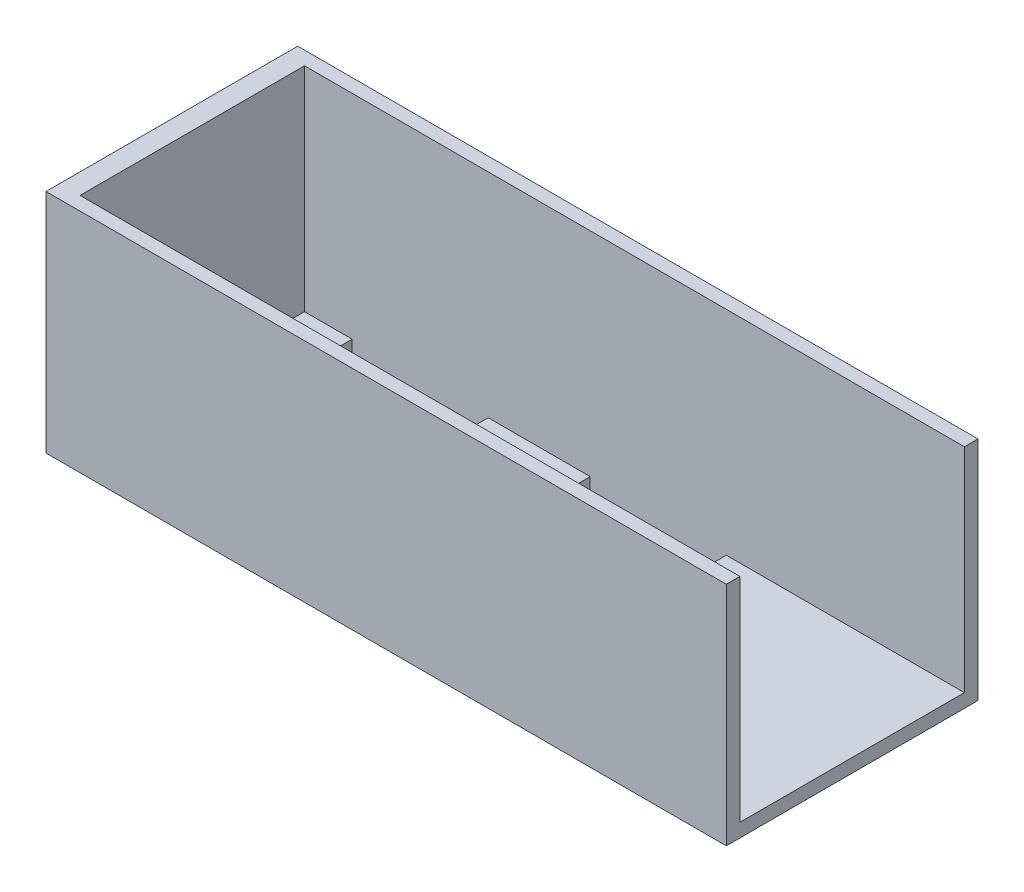
ISO-10303-21;
HEADER;
FILE_DESCRIPTION(('STEP AP214'),'2;1');
FILE_NAME('part.step','',(''),(''),'','','');
FILE_SCHEMA(('AUTOMOTIVE_DESIGN { 1 0 10303 214 1 1 1 1 }'));
ENDSEC;
DATA;
#1=APPLICATION_CONTEXT('core data for automotive mechanical design processes');
#2=APPLICATION_PROTOCOL_DEFINITION('international standard','automotive_design',2000,#1);
#3=PRODUCT_CONTEXT('',#1,'mechanical');
#4=PRODUCT('Part','Part','',(#3));
#5=PRODUCT_RELATED_PRODUCT_CATEGORY('part','',(#4));
#6=PRODUCT_DEFINITION_FORMATION('','',#4);
#7=PRODUCT_DEFINITION_CONTEXT('part definition',#1,'design');
#8=PRODUCT_DEFINITION('design','',#6,#7);
#9=PRODUCT_DEFINITION_SHAPE('','',#8);
#10=(LENGTH_UNIT() NAMED_UNIT(*) SI_UNIT(.MILLI.,.METRE.));
#11=(NAMED_UNIT(*) PLANE_ANGLE_UNIT() SI_UNIT($,.RADIAN.));
#12=(NAMED_UNIT(*) SI_UNIT($,.STERADIAN.) SOLID_ANGLE_UNIT());
#13=UNCERTAINTY_MEASURE_WITH_UNIT(LENGTH_MEASURE(1.E-05),#10,'distance_accuracy_value','');
#14=(GEOMETRIC_REPRESENTATION_CONTEXT(3) GLOBAL_UNCERTAINTY_ASSIGNED_CONTEXT((#13)) GLOBAL_UNIT_ASSIGNED_CONTEXT((#10,
#11,#12)) REPRESENTATION_CONTEXT('',''));
#15=CARTESIAN_POINT('',(0.,0.,0.));
#16=DIRECTION('',(0.,0.,1.));
#17=DIRECTION('',(1.,0.,0.));
#18=AXIS2_PLACEMENT_3D('',#15,#16,#17);
#19=CARTESIAN_POINT('',(50.,0.,-16.));
#20=DIRECTION('',(0.,0.,-1.));
#21=DIRECTION('',(0.,1.,0.));
#22=AXIS2_PLACEMENT_3D('',#19,#20,#21);
#23=PLANE('',#22);
#24=DIRECTION('',(-1.,0.,0.));
#25=VECTOR('',#24,1.);
#26=CARTESIAN_POINT('',(50.,0.,-16.));
#27=LINE('',#26,#25);
#28=CARTESIAN_POINT('',(50.,0.,-16.));
#29=VERTEX_POINT('',#28);
#30=CARTESIAN_POINT('',(-47.,0.,-16.));
#31=VERTEX_POINT('',#30);
#32=EDGE_CURVE('E384',#29,#31,#27,.T.);
#33=ORIENTED_EDGE('',*,*,#32,.T.);
#34=DIRECTION('',(0.,1.,0.));
#35=VECTOR('',#34,1.);
#36=CARTESIAN_POINT('',(-47.,0.,-16.));
#37=LINE('',#36,#35);
#38=CARTESIAN_POINT('',(-47.,-31.3,-16.));
#39=VERTEX_POINT('',#38);
#40=EDGE_CURVE('E325',#39,#31,#37,.T.);
#41=ORIENTED_EDGE('',*,*,#40,.F.);
#42=DIRECTION('',(-1.,0.,0.));
#43=VECTOR('',#42,1.);
#44=CARTESIAN_POINT('',(50.,-31.3,-16.));
#45=LINE('',#44,#43);
#46=CARTESIAN_POINT('',(-40.,-31.3,-16.));
#47=VERTEX_POINT('',#46);
#48=EDGE_CURVE('E378',#47,#39,#45,.T.);
#49=ORIENTED_EDGE('',*,*,#48,.F.);
#50=DIRECTION('',(0.,1.,0.));
#51=VECTOR('',#50,1.);
#52=CARTESIAN_POINT('',(-40.,-50.,-16.));
#53=LINE('',#52,#51);
#54=CARTESIAN_POINT('',(-40.,-33.3,-16.));
#55=VERTEX_POINT('',#54);
#56=EDGE_CURVE('E463',#55,#47,#53,.T.);
#57=ORIENTED_EDGE('',*,*,#56,.F.);
#58=DIRECTION('',(-1.,0.,0.));
#59=VECTOR('',#58,1.);
#60=CARTESIAN_POINT('',(50.,-33.3,-16.));
#61=LINE('',#60,#59);
#62=CARTESIAN_POINT('',(-20.,-33.3,-16.));
#63=VERTEX_POINT('',#62);
#64=EDGE_CURVE('E269',#63,#55,#61,.T.);
#65=ORIENTED_EDGE('',*,*,#64,.F.);
#66=DIRECTION('',(0.,1.,0.));
#67=VECTOR('',#66,1.);
#68=CARTESIAN_POINT('',(-20.,-50.,-16.));
#69=LINE('',#68,#67);
#70=CARTESIAN_POINT('',(-20.,-31.3,-16.));
#71=VERTEX_POINT('',#70);
#72=EDGE_CURVE('E425',#63,#71,#69,.T.);
#73=ORIENTED_EDGE('',*,*,#72,.T.);
#74=CARTESIAN_POINT('',(-4.99999999999999,-31.3,-16.));
#75=VERTEX_POINT('',#74);
#76=EDGE_CURVE('E385',#75,#71,#45,.T.);
#77=ORIENTED_EDGE('',*,*,#76,.F.);
#78=DIRECTION('',(0.,1.,0.));
#79=VECTOR('',#78,1.);
#80=CARTESIAN_POINT('',(-4.99999999999999,-50.,-16.));
#81=LINE('',#80,#79);
#82=CARTESIAN_POINT('',(-4.99999999999999,-33.3,-16.));
#83=VERTEX_POINT('',#82);
#84=EDGE_CURVE('E421',#83,#75,#81,.T.);
#85=ORIENTED_EDGE('',*,*,#84,.F.);
#86=DIRECTION('',(-1.,0.,0.));
#87=VECTOR('',#86,1.);
#88=CARTESIAN_POINT('',(50.,-33.3,-16.));
#89=LINE('',#88,#87);
#90=CARTESIAN_POINT('',(15.,-33.3,-16.));
#91=VERTEX_POINT('',#90);
#92=EDGE_CURVE('E249',#91,#83,#89,.T.);
#93=ORIENTED_EDGE('',*,*,#92,.F.);
#94=DIRECTION('',(0.,1.,0.));
#95=VECTOR('',#94,1.);
#96=CARTESIAN_POINT('',(15.,-50.,-16.));
#97=LINE('',#96,#95);
#98=CARTESIAN_POINT('',(15.,-31.3,-16.));
#99=VERTEX_POINT('',#98);
#100=EDGE_CURVE('E427',#91,#99,#97,.T.);
#101=ORIENTED_EDGE('',*,*,#100,.T.);
#102=CARTESIAN_POINT('',(50.,-31.3,-16.));
#103=VERTEX_POINT('',#102);
#104=EDGE_CURVE('E380',#103,#99,#45,.T.);
#105=ORIENTED_EDGE('',*,*,#104,.F.);
#106=DIRECTION('',(0.,-1.,0.));
#107=VECTOR('',#106,1.);
#108=CARTESIAN_POINT('',(50.,0.,-16.));
#109=LINE('',#108,#107);
#110=EDGE_CURVE('E347',#29,#103,#109,.T.);
#111=ORIENTED_EDGE('',*,*,#110,.F.);
#112=EDGE_LOOP('',(#33,#41,#49,#57,#65,#73,#77,#85,#93,#101,#105,#111));
#113=FACE_BOUND('',#112,.T.);
#114=ADVANCED_FACE('F39',(#113),#23,.F.);
#115=CARTESIAN_POINT('',(50.,-31.3,17.));
#116=DIRECTION('',(0.,-1.,0.));
#117=DIRECTION('',(0.,0.,-1.));
#118=AXIS2_PLACEMENT_3D('',#115,#116,#117);
#119=PLANE('',#118);
#120=DIRECTION('',(1.,0.,0.));
#121=VECTOR('',#120,1.);
#122=CARTESIAN_POINT('',(50.,-31.3,9.99999999999999));
#123=LINE('',#122,#121);
#124=CARTESIAN_POINT('',(-4.99999999999999,-31.3,10.));
#125=VERTEX_POINT('',#124);
#126=CARTESIAN_POINT('',(15.,-31.3,10.));
#127=VERTEX_POINT('',#126);
#128=EDGE_CURVE('E313',#125,#127,#123,.T.);
#129=ORIENTED_EDGE('',*,*,#128,.T.);
#130=DIRECTION('',(0.,0.,1.));
#131=VECTOR('',#130,1.);
#132=CARTESIAN_POINT('',(15.,-31.3,17.));
#133=LINE('',#132,#131);
#134=CARTESIAN_POINT('',(15.,-31.3,17.));
#135=VERTEX_POINT('',#134);
#136=EDGE_CURVE('E297',#127,#135,#133,.T.);
#137=ORIENTED_EDGE('',*,*,#136,.T.);
#138=DIRECTION('',(-1.,0.,0.));
#139=VECTOR('',#138,1.);
#140=CARTESIAN_POINT('',(50.,-31.3,17.));
#141=LINE('',#140,#139);
#142=CARTESIAN_POINT('',(50.,-31.3,17.));
#143=VERTEX_POINT('',#142);
#144=EDGE_CURVE('E374',#143,#135,#141,.T.);
#145=ORIENTED_EDGE('',*,*,#144,.F.);
#146=DIRECTION('',(0.,0.,1.));
#147=VECTOR('',#146,1.);
#148=CARTESIAN_POINT('',(50.,-31.3,17.));
#149=LINE('',#148,#147);
#150=EDGE_CURVE('E350',#103,#143,#149,.T.);
#151=ORIENTED_EDGE('',*,*,#150,.F.);
#152=ORIENTED_EDGE('',*,*,#104,.T.);
#153=DIRECTION('',(0.,0.,1.));
#154=VECTOR('',#153,1.);
#155=CARTESIAN_POINT('',(15.,-31.3,17.));
#156=LINE('',#155,#154);
#157=CARTESIAN_POINT('',(15.,-31.3,-9.));
#158=VERTEX_POINT('',#157);
#159=EDGE_CURVE('E245',#99,#158,#156,.T.);
#160=ORIENTED_EDGE('',*,*,#159,.T.);
#161=DIRECTION('',(-1.,0.,0.));
#162=VECTOR('',#161,1.);
#163=CARTESIAN_POINT('',(50.,-31.3,-9.));
#164=LINE('',#163,#162);
#165=CARTESIAN_POINT('',(-4.99999999999999,-31.3,-9.));
#166=VERTEX_POINT('',#165);
#167=EDGE_CURVE('E305',#158,#166,#164,.T.);
#168=ORIENTED_EDGE('',*,*,#167,.T.);
#169=DIRECTION('',(0.,0.,-1.));
#170=VECTOR('',#169,1.);
#171=CARTESIAN_POINT('',(-4.99999999999999,-31.3,17.));
#172=LINE('',#171,#170);
#173=EDGE_CURVE('E257',#166,#75,#172,.T.);
#174=ORIENTED_EDGE('',*,*,#173,.T.);
#175=ORIENTED_EDGE('',*,*,#76,.T.);
#176=DIRECTION('',(0.,0.,1.));
#177=VECTOR('',#176,1.);
#178=CARTESIAN_POINT('',(-20.,-31.3,17.));
#179=LINE('',#178,#177);
#180=CARTESIAN_POINT('',(-20.,-31.3,-9.));
#181=VERTEX_POINT('',#180);
#182=EDGE_CURVE('E265',#71,#181,#179,.T.);
#183=ORIENTED_EDGE('',*,*,#182,.T.);
#184=DIRECTION('',(-1.,0.,0.));
#185=VECTOR('',#184,1.);
#186=CARTESIAN_POINT('',(50.,-31.3,-9.));
#187=LINE('',#186,#185);
#188=CARTESIAN_POINT('',(-40.,-31.3,-9.));
#189=VERTEX_POINT('',#188);
#190=EDGE_CURVE('E309',#181,#189,#187,.T.);
#191=ORIENTED_EDGE('',*,*,#190,.T.);
#192=DIRECTION('',(0.,0.,-1.));
#193=VECTOR('',#192,1.);
#194=CARTESIAN_POINT('',(-40.,-31.3,17.));
#195=LINE('',#194,#193);
#196=EDGE_CURVE('E277',#189,#47,#195,.T.);
#197=ORIENTED_EDGE('',*,*,#196,.T.);
#198=ORIENTED_EDGE('',*,*,#48,.T.);
#199=DIRECTION('',(0.,0.,-1.));
#200=VECTOR('',#199,1.);
#201=CARTESIAN_POINT('',(-47.,-31.3,17.));
#202=LINE('',#201,#200);
#203=CARTESIAN_POINT('',(-47.,-31.3,17.));
#204=VERTEX_POINT('',#203);
#205=EDGE_CURVE('E321',#204,#39,#202,.T.);
#206=ORIENTED_EDGE('',*,*,#205,.F.);
#207=CARTESIAN_POINT('',(-40.,-31.3,17.));
#208=VERTEX_POINT('',#207);
#209=EDGE_CURVE('E373',#208,#204,#141,.T.);
#210=ORIENTED_EDGE('',*,*,#209,.F.);
#211=DIRECTION('',(0.,0.,-1.));
#212=VECTOR('',#211,1.);
#213=CARTESIAN_POINT('',(-40.,-31.3,17.));
#214=LINE('',#213,#212);
#215=CARTESIAN_POINT('',(-40.,-31.3,9.99999999999998));
#216=VERTEX_POINT('',#215);
#217=EDGE_CURVE('E222',#208,#216,#214,.T.);
#218=ORIENTED_EDGE('',*,*,#217,.T.);
#219=DIRECTION('',(1.,0.,0.));
#220=VECTOR('',#219,1.);
#221=CARTESIAN_POINT('',(50.,-31.3,9.99999999999998));
#222=LINE('',#221,#220);
#223=CARTESIAN_POINT('',(-20.,-31.3,9.99999999999998));
#224=VERTEX_POINT('',#223);
#225=EDGE_CURVE('E301',#216,#224,#222,.T.);
#226=ORIENTED_EDGE('',*,*,#225,.T.);
#227=DIRECTION('',(0.,0.,1.));
#228=VECTOR('',#227,1.);
#229=CARTESIAN_POINT('',(-20.,-31.3,17.));
#230=LINE('',#229,#228);
#231=CARTESIAN_POINT('',(-20.,-31.3,17.));
#232=VERTEX_POINT('',#231);
#233=EDGE_CURVE('E232',#224,#232,#230,.T.);
#234=ORIENTED_EDGE('',*,*,#233,.T.);
#235=CARTESIAN_POINT('',(-4.99999999999999,-31.3,17.));
#236=VERTEX_POINT('',#235);
#237=EDGE_CURVE('E379',#236,#232,#141,.T.);
#238=ORIENTED_EDGE('',*,*,#237,.F.);
#239=DIRECTION('',(0.,0.,-1.));
#240=VECTOR('',#239,1.);
#241=CARTESIAN_POINT('',(-4.99999999999999,-31.3,17.));
#242=LINE('',#241,#240);
#243=EDGE_CURVE('E285',#236,#125,#242,.T.);
#244=ORIENTED_EDGE('',*,*,#243,.T.);
#245=EDGE_LOOP('',(#129,#137,#145,#151,#152,#160,#168,#174,#175,#183,#191,#197,#198,#206,#210,
#218,#226,#234,#238,#244));
#246=FACE_BOUND('',#245,.T.);
#247=ADVANCED_FACE('F445',(#246),#119,.F.);
#248=CARTESIAN_POINT('',(50.,0.,17.));
#249=DIRECTION('',(0.,0.,1.));
#250=DIRECTION('',(0.,-1.,0.));
#251=AXIS2_PLACEMENT_3D('',#248,#249,#250);
#252=PLANE('',#251);
#253=DIRECTION('',(0.,-1.,0.));
#254=VECTOR('',#253,1.);
#255=CARTESIAN_POINT('',(-47.,0.,17.));
#256=LINE('',#255,#254);
#257=CARTESIAN_POINT('',(-47.,0.,17.));
#258=VERTEX_POINT('',#257);
#259=EDGE_CURVE('E400',#258,#204,#256,.T.);
#260=ORIENTED_EDGE('',*,*,#259,.F.);
#261=DIRECTION('',(-1.,0.,0.));
#262=VECTOR('',#261,1.);
#263=CARTESIAN_POINT('',(50.,0.,17.));
#264=LINE('',#263,#262);
#265=CARTESIAN_POINT('',(50.,0.,17.));
#266=VERTEX_POINT('',#265);
#267=EDGE_CURVE('E356',#266,#258,#264,.T.);
#268=ORIENTED_EDGE('',*,*,#267,.F.);
#269=DIRECTION('',(0.,1.,0.));
#270=VECTOR('',#269,1.);
#271=CARTESIAN_POINT('',(50.,0.,17.));
#272=LINE('',#271,#270);
#273=EDGE_CURVE('E353',#143,#266,#272,.T.);
#274=ORIENTED_EDGE('',*,*,#273,.F.);
#275=ORIENTED_EDGE('',*,*,#144,.T.);
#276=DIRECTION('',(0.,1.,0.));
#277=VECTOR('',#276,1.);
#278=CARTESIAN_POINT('',(15.,-50.,17.));
#279=LINE('',#278,#277);
#280=CARTESIAN_POINT('',(15.,-33.3,17.));
#281=VERTEX_POINT('',#280);
#282=EDGE_CURVE('E225',#281,#135,#279,.T.);
#283=ORIENTED_EDGE('',*,*,#282,.F.);
#284=DIRECTION('',(1.,0.,0.));
#285=VECTOR('',#284,1.);
#286=CARTESIAN_POINT('',(50.,-33.3,17.));
#287=LINE('',#286,#285);
#288=CARTESIAN_POINT('',(-4.99999999999999,-33.3,17.));
#289=VERTEX_POINT('',#288);
#290=EDGE_CURVE('E289',#289,#281,#287,.T.);
#291=ORIENTED_EDGE('',*,*,#290,.F.);
#292=DIRECTION('',(0.,1.,0.));
#293=VECTOR('',#292,1.);
#294=CARTESIAN_POINT('',(-4.99999999999999,-50.,17.));
#295=LINE('',#294,#293);
#296=EDGE_CURVE('E452',#289,#236,#295,.T.);
#297=ORIENTED_EDGE('',*,*,#296,.T.);
#298=ORIENTED_EDGE('',*,*,#237,.T.);
#299=DIRECTION('',(0.,1.,0.));
#300=VECTOR('',#299,1.);
#301=CARTESIAN_POINT('',(-20.,-50.,17.));
#302=LINE('',#301,#300);
#303=CARTESIAN_POINT('',(-20.,-33.3,17.));
#304=VERTEX_POINT('',#303);
#305=EDGE_CURVE('E207',#304,#232,#302,.T.);
#306=ORIENTED_EDGE('',*,*,#305,.F.);
#307=DIRECTION('',(1.,0.,0.));
#308=VECTOR('',#307,1.);
#309=CARTESIAN_POINT('',(50.,-33.3,17.));
#310=LINE('',#309,#308);
#311=CARTESIAN_POINT('',(-40.,-33.3,17.));
#312=VERTEX_POINT('',#311);
#313=EDGE_CURVE('E200',#312,#304,#310,.T.);
#314=ORIENTED_EDGE('',*,*,#313,.F.);
#315=DIRECTION('',(0.,1.,0.));
#316=VECTOR('',#315,1.);
#317=CARTESIAN_POINT('',(-40.,-50.,17.));
#318=LINE('',#317,#316);
#319=EDGE_CURVE('E204',#312,#208,#318,.T.);
#320=ORIENTED_EDGE('',*,*,#319,.T.);
#321=ORIENTED_EDGE('',*,*,#209,.T.);
#322=EDGE_LOOP('',(#260,#268,#274,#275,#283,#291,#297,#298,#306,#314,#320,#321));
#323=FACE_BOUND('',#322,.T.);
#324=ADVANCED_FACE('F203',(#323),#252,.F.);
#325=CARTESIAN_POINT('',(50.,0.,19.));
#326=DIRECTION('',(0.,0.,-1.));
#327=DIRECTION('',(0.,1.,0.));
#328=AXIS2_PLACEMENT_3D('',#325,#326,#327);
#329=PLANE('',#328);
#330=DIRECTION('',(0.,-1.,0.));
#331=VECTOR('',#330,1.);
#332=CARTESIAN_POINT('',(-50.,0.,19.));
#333=LINE('',#332,#331);
#334=CARTESIAN_POINT('',(-50.,0.,19.));
#335=VERTEX_POINT('',#334);
#336=CARTESIAN_POINT('',(-50.,-33.3,19.));
#337=VERTEX_POINT('',#336);
#338=EDGE_CURVE('E329',#335,#337,#333,.T.);
#339=ORIENTED_EDGE('',*,*,#338,.T.);
#340=DIRECTION('',(-1.,0.,0.));
#341=VECTOR('',#340,1.);
#342=CARTESIAN_POINT('',(50.,-33.3,19.));
#343=LINE('',#342,#341);
#344=CARTESIAN_POINT('',(50.,-33.3,19.));
#345=VERTEX_POINT('',#344);
#346=EDGE_CURVE('E394',#345,#337,#343,.T.);
#347=ORIENTED_EDGE('',*,*,#346,.F.);
#348=DIRECTION('',(0.,-1.,0.));
#349=VECTOR('',#348,1.);
#350=CARTESIAN_POINT('',(50.,0.,19.));
#351=LINE('',#350,#349);
#352=CARTESIAN_POINT('',(50.,0.,19.));
#353=VERTEX_POINT('',#352);
#354=EDGE_CURVE('E334',#353,#345,#351,.T.);
#355=ORIENTED_EDGE('',*,*,#354,.F.);
#356=DIRECTION('',(-1.,0.,0.));
#357=VECTOR('',#356,1.);
#358=CARTESIAN_POINT('',(50.,0.,19.));
#359=LINE('',#358,#357);
#360=EDGE_CURVE('E397',#353,#335,#359,.T.);
#361=ORIENTED_EDGE('',*,*,#360,.T.);
#362=EDGE_LOOP('',(#339,#347,#355,#361));
#363=FACE_BOUND('',#362,.T.);
#364=ADVANCED_FACE('F41',(#363),#329,.F.);
#365=CARTESIAN_POINT('',(50.,-33.3,19.));
#366=DIRECTION('',(0.,1.,0.));
#367=DIRECTION('',(0.,0.,1.));
#368=AXIS2_PLACEMENT_3D('',#365,#366,#367);
#369=PLANE('',#368);
#370=ORIENTED_EDGE('',*,*,#290,.T.);
#371=DIRECTION('',(0.,0.,-1.));
#372=VECTOR('',#371,1.);
#373=CARTESIAN_POINT('',(15.,-33.3,19.));
#374=LINE('',#373,#372);
#375=CARTESIAN_POINT('',(15.,-33.3,10.));
#376=VERTEX_POINT('',#375);
#377=EDGE_CURVE('E293',#281,#376,#374,.T.);
#378=ORIENTED_EDGE('',*,*,#377,.T.);
#379=DIRECTION('',(-1.,0.,0.));
#380=VECTOR('',#379,1.);
#381=CARTESIAN_POINT('',(50.,-33.3,10.));
#382=LINE('',#381,#380);
#383=CARTESIAN_POINT('',(-4.99999999999999,-33.3,10.));
#384=VERTEX_POINT('',#383);
#385=EDGE_CURVE('E11',#376,#384,#382,.T.);
#386=ORIENTED_EDGE('',*,*,#385,.T.);
#387=DIRECTION('',(0.,0.,1.));
#388=VECTOR('',#387,1.);
#389=CARTESIAN_POINT('',(-4.99999999999999,-33.3,19.));
#390=LINE('',#389,#388);
#391=EDGE_CURVE('E281',#384,#289,#390,.T.);
#392=ORIENTED_EDGE('',*,*,#391,.T.);
#393=EDGE_LOOP('',(#370,#378,#386,#392));
#394=FACE_BOUND('',#393,.T.);
#395=ORIENTED_EDGE('',*,*,#64,.T.);
#396=DIRECTION('',(0.,0.,1.));
#397=VECTOR('',#396,1.);
#398=CARTESIAN_POINT('',(-40.,-33.3,19.));
#399=LINE('',#398,#397);
#400=CARTESIAN_POINT('',(-40.,-33.3,-9.));
#401=VERTEX_POINT('',#400);
#402=EDGE_CURVE('E273',#55,#401,#399,.T.);
#403=ORIENTED_EDGE('',*,*,#402,.T.);
#404=DIRECTION('',(1.,0.,0.));
#405=VECTOR('',#404,1.);
#406=CARTESIAN_POINT('',(50.,-33.3,-9.));
#407=LINE('',#406,#405);
#408=CARTESIAN_POINT('',(-20.,-33.3,-9.));
#409=VERTEX_POINT('',#408);
#410=EDGE_CURVE('E48',#401,#409,#407,.T.);
#411=ORIENTED_EDGE('',*,*,#410,.T.);
#412=DIRECTION('',(0.,0.,-1.));
#413=VECTOR('',#412,1.);
#414=CARTESIAN_POINT('',(-20.,-33.3,19.));
#415=LINE('',#414,#413);
#416=EDGE_CURVE('E261',#409,#63,#415,.T.);
#417=ORIENTED_EDGE('',*,*,#416,.T.);
#418=EDGE_LOOP('',(#395,#403,#411,#417));
#419=FACE_BOUND('',#418,.T.);
#420=ORIENTED_EDGE('',*,*,#92,.T.);
#421=DIRECTION('',(0.,0.,1.));
#422=VECTOR('',#421,1.);
#423=CARTESIAN_POINT('',(-4.99999999999999,-33.3,19.));
#424=LINE('',#423,#422);
#425=CARTESIAN_POINT('',(-4.99999999999999,-33.3,-9.));
#426=VERTEX_POINT('',#425);
#427=EDGE_CURVE('E253',#83,#426,#424,.T.);
#428=ORIENTED_EDGE('',*,*,#427,.T.);
#429=DIRECTION('',(1.,0.,0.));
#430=VECTOR('',#429,1.);
#431=CARTESIAN_POINT('',(50.,-33.3,-9.));
#432=LINE('',#431,#430);
#433=CARTESIAN_POINT('',(15.,-33.3,-9.));
#434=VERTEX_POINT('',#433);
#435=EDGE_CURVE('E406',#426,#434,#432,.T.);
#436=ORIENTED_EDGE('',*,*,#435,.T.);
#437=DIRECTION('',(0.,0.,-1.));
#438=VECTOR('',#437,1.);
#439=CARTESIAN_POINT('',(15.,-33.3,19.));
#440=LINE('',#439,#438);
#441=EDGE_CURVE('E236',#434,#91,#440,.T.);
#442=ORIENTED_EDGE('',*,*,#441,.T.);
#443=EDGE_LOOP('',(#420,#428,#436,#442));
#444=FACE_BOUND('',#443,.T.);
#445=DIRECTION('',(-1.,0.,0.));
#446=VECTOR('',#445,1.);
#447=CARTESIAN_POINT('',(50.,-33.3,9.99999999999998));
#448=LINE('',#447,#446);
#449=CARTESIAN_POINT('',(-20.,-33.3,9.99999999999998));
#450=VERTEX_POINT('',#449);
#451=CARTESIAN_POINT('',(-40.,-33.3,9.99999999999998));
#452=VERTEX_POINT('',#451);
#453=EDGE_CURVE('E230',#450,#452,#448,.T.);
#454=ORIENTED_EDGE('',*,*,#453,.T.);
#455=DIRECTION('',(0.,0.,1.));
#456=VECTOR('',#455,1.);
#457=CARTESIAN_POINT('',(-40.,-33.3,19.));
#458=LINE('',#457,#456);
#459=EDGE_CURVE('E219',#452,#312,#458,.T.);
#460=ORIENTED_EDGE('',*,*,#459,.T.);
#461=ORIENTED_EDGE('',*,*,#313,.T.);
#462=DIRECTION('',(0.,0.,-1.));
#463=VECTOR('',#462,1.);
#464=CARTESIAN_POINT('',(-20.,-33.3,19.));
#465=LINE('',#464,#463);
#466=EDGE_CURVE('E213',#304,#450,#465,.T.);
#467=ORIENTED_EDGE('',*,*,#466,.T.);
#468=EDGE_LOOP('',(#454,#460,#461,#467));
#469=FACE_BOUND('',#468,.T.);
#470=DIRECTION('',(0.,0.,-1.));
#471=VECTOR('',#470,1.);
#472=CARTESIAN_POINT('',(-50.,-33.3,19.));
#473=LINE('',#472,#471);
#474=CARTESIAN_POINT('',(-50.,-33.3,-18.));
#475=VERTEX_POINT('',#474);
#476=EDGE_CURVE('E360',#337,#475,#473,.T.);
#477=ORIENTED_EDGE('',*,*,#476,.T.);
#478=DIRECTION('',(-1.,0.,0.));
#479=VECTOR('',#478,1.);
#480=CARTESIAN_POINT('',(50.,-33.3,-18.));
#481=LINE('',#480,#479);
#482=CARTESIAN_POINT('',(50.,-33.3,-18.));
#483=VERTEX_POINT('',#482);
#484=EDGE_CURVE('E391',#483,#475,#481,.T.);
#485=ORIENTED_EDGE('',*,*,#484,.F.);
#486=DIRECTION('',(0.,0.,-1.));
#487=VECTOR('',#486,1.);
#488=CARTESIAN_POINT('',(50.,-33.3,19.));
#489=LINE('',#488,#487);
#490=EDGE_CURVE('E338',#345,#483,#489,.T.);
#491=ORIENTED_EDGE('',*,*,#490,.F.);
#492=ORIENTED_EDGE('',*,*,#346,.T.);
#493=EDGE_LOOP('',(#477,#485,#491,#492));
#494=FACE_BOUND('',#493,.T.);
#495=ADVANCED_FACE('F228',(#394,#419,#444,#469,#494),#369,.F.);
#496=CARTESIAN_POINT('',(50.,-33.3,-18.));
#497=DIRECTION('',(0.,0.,1.));
#498=DIRECTION('',(1.,0.,0.));
#499=AXIS2_PLACEMENT_3D('',#496,#497,#498);
#500=PLANE('',#499);
#501=DIRECTION('',(0.,1.,0.));
#502=VECTOR('',#501,1.);
#503=CARTESIAN_POINT('',(-50.,-33.3,-18.));
#504=LINE('',#503,#502);
#505=CARTESIAN_POINT('',(-50.,0.,-18.));
#506=VERTEX_POINT('',#505);
#507=EDGE_CURVE('E364',#475,#506,#504,.T.);
#508=ORIENTED_EDGE('',*,*,#507,.T.);
#509=DIRECTION('',(-1.,0.,0.));
#510=VECTOR('',#509,1.);
#511=CARTESIAN_POINT('',(50.,0.,-18.));
#512=LINE('',#511,#510);
#513=CARTESIAN_POINT('',(50.,0.,-18.));
#514=VERTEX_POINT('',#513);
#515=EDGE_CURVE('E388',#514,#506,#512,.T.);
#516=ORIENTED_EDGE('',*,*,#515,.F.);
#517=DIRECTION('',(0.,1.,0.));
#518=VECTOR('',#517,1.);
#519=CARTESIAN_POINT('',(50.,-33.3,-18.));
#520=LINE('',#519,#518);
#521=EDGE_CURVE('E341',#483,#514,#520,.T.);
#522=ORIENTED_EDGE('',*,*,#521,.F.);
#523=ORIENTED_EDGE('',*,*,#484,.T.);
#524=EDGE_LOOP('',(#508,#516,#522,#523));
#525=FACE_BOUND('',#524,.T.);
#526=ADVANCED_FACE('F524',(#525),#500,.F.);
#527=CARTESIAN_POINT('',(50.,0.,-16.));
#528=DIRECTION('',(0.,-1.,0.));
#529=DIRECTION('',(0.,0.,-1.));
#530=AXIS2_PLACEMENT_3D('',#527,#528,#529);
#531=PLANE('',#530);
#532=DIRECTION('',(0.,0.,1.));
#533=VECTOR('',#532,1.);
#534=CARTESIAN_POINT('',(-50.,0.,-16.));
#535=LINE('',#534,#533);
#536=EDGE_CURVE('E335',#506,#335,#535,.T.);
#537=ORIENTED_EDGE('',*,*,#536,.T.);
#538=ORIENTED_EDGE('',*,*,#360,.F.);
#539=DIRECTION('',(0.,0.,1.));
#540=VECTOR('',#539,1.);
#541=CARTESIAN_POINT('',(50.,0.,19.));
#542=LINE('',#541,#540);
#543=EDGE_CURVE('E330',#266,#353,#542,.T.);
#544=ORIENTED_EDGE('',*,*,#543,.F.);
#545=ORIENTED_EDGE('',*,*,#267,.T.);
#546=DIRECTION('',(0.,0.,-1.));
#547=VECTOR('',#546,1.);
#548=CARTESIAN_POINT('',(-47.,0.,-18.));
#549=LINE('',#548,#547);
#550=EDGE_CURVE('E317',#258,#31,#549,.T.);
#551=ORIENTED_EDGE('',*,*,#550,.T.);
#552=ORIENTED_EDGE('',*,*,#32,.F.);
#553=DIRECTION('',(0.,0.,1.));
#554=VECTOR('',#553,1.);
#555=CARTESIAN_POINT('',(50.,0.,-16.));
#556=LINE('',#555,#554);
#557=EDGE_CURVE('E344',#514,#29,#556,.T.);
#558=ORIENTED_EDGE('',*,*,#557,.F.);
#559=ORIENTED_EDGE('',*,*,#515,.T.);
#560=EDGE_LOOP('',(#537,#538,#544,#545,#551,#552,#558,#559));
#561=FACE_BOUND('',#560,.T.);
#562=ADVANCED_FACE('F491',(#561),#531,.F.);
#563=CARTESIAN_POINT('',(50.,0.,0.));
#564=DIRECTION('',(-1.,0.,0.));
#565=DIRECTION('',(0.,0.,1.));
#566=AXIS2_PLACEMENT_3D('',#563,#564,#565);
#567=PLANE('',#566);
#568=ORIENTED_EDGE('',*,*,#543,.T.);
#569=ORIENTED_EDGE('',*,*,#354,.T.);
#570=ORIENTED_EDGE('',*,*,#490,.T.);
#571=ORIENTED_EDGE('',*,*,#521,.T.);
#572=ORIENTED_EDGE('',*,*,#557,.T.);
#573=ORIENTED_EDGE('',*,*,#110,.T.);
#574=ORIENTED_EDGE('',*,*,#150,.T.);
#575=ORIENTED_EDGE('',*,*,#273,.T.);
#576=EDGE_LOOP('',(#568,#569,#570,#571,#572,#573,#574,#575));
#577=FACE_BOUND('',#576,.T.);
#578=ADVANCED_FACE('F493',(#577),#567,.F.);
#579=CARTESIAN_POINT('',(-50.,0.,0.));
#580=DIRECTION('',(-1.,0.,0.));
#581=DIRECTION('',(0.,0.,1.));
#582=AXIS2_PLACEMENT_3D('',#579,#580,#581);
#583=PLANE('',#582);
#584=ORIENTED_EDGE('',*,*,#338,.F.);
#585=ORIENTED_EDGE('',*,*,#536,.F.);
#586=ORIENTED_EDGE('',*,*,#507,.F.);
#587=ORIENTED_EDGE('',*,*,#476,.F.);
#588=EDGE_LOOP('',(#584,#585,#586,#587));
#589=FACE_BOUND('',#588,.T.);
#590=ADVANCED_FACE('F541',(#589),#583,.T.);
#591=CARTESIAN_POINT('',(-47.,0.,0.));
#592=DIRECTION('',(-1.,0.,0.));
#593=DIRECTION('',(0.,0.,1.));
#594=AXIS2_PLACEMENT_3D('',#591,#592,#593);
#595=PLANE('',#594);
#596=ORIENTED_EDGE('',*,*,#205,.T.);
#597=ORIENTED_EDGE('',*,*,#40,.T.);
#598=ORIENTED_EDGE('',*,*,#550,.F.);
#599=ORIENTED_EDGE('',*,*,#259,.T.);
#600=EDGE_LOOP('',(#596,#597,#598,#599));
#601=FACE_BOUND('',#600,.T.);
#602=ADVANCED_FACE('F485',(#601),#595,.F.);
#603=CARTESIAN_POINT('',(-40.,-50.,9.99999999999998));
#604=DIRECTION('',(0.,0.,-1.));
#605=DIRECTION('',(-1.,0.,0.));
#606=AXIS2_PLACEMENT_3D('',#603,#604,#605);
#607=PLANE('',#606);
#608=DIRECTION('',(0.,1.,0.));
#609=VECTOR('',#608,1.);
#610=CARTESIAN_POINT('',(-40.,-50.,9.99999999999998));
#611=LINE('',#610,#609);
#612=EDGE_CURVE('E214',#452,#216,#611,.T.);
#613=ORIENTED_EDGE('',*,*,#612,.F.);
#614=ORIENTED_EDGE('',*,*,#453,.F.);
#615=DIRECTION('',(0.,1.,0.));
#616=VECTOR('',#615,1.);
#617=CARTESIAN_POINT('',(-20.,-50.,9.99999999999998));
#618=LINE('',#617,#616);
#619=EDGE_CURVE('E433',#450,#224,#618,.T.);
#620=ORIENTED_EDGE('',*,*,#619,.T.);
#621=ORIENTED_EDGE('',*,*,#225,.F.);
#622=EDGE_LOOP('',(#613,#614,#620,#621));
#623=FACE_BOUND('',#622,.T.);
#624=ADVANCED_FACE('F443',(#623),#607,.F.);
#625=CARTESIAN_POINT('',(-40.,-50.,17.));
#626=DIRECTION('',(-1.,0.,0.));
#627=DIRECTION('',(0.,0.,1.));
#628=AXIS2_PLACEMENT_3D('',#625,#626,#627);
#629=PLANE('',#628);
#630=ORIENTED_EDGE('',*,*,#319,.F.);
#631=ORIENTED_EDGE('',*,*,#459,.F.);
#632=ORIENTED_EDGE('',*,*,#612,.T.);
#633=ORIENTED_EDGE('',*,*,#217,.F.);
#634=EDGE_LOOP('',(#630,#631,#632,#633));
#635=FACE_BOUND('',#634,.T.);
#636=ADVANCED_FACE('F217',(#635),#629,.F.);
#637=CARTESIAN_POINT('',(-20.,-50.,17.));
#638=DIRECTION('',(1.,0.,0.));
#639=DIRECTION('',(0.,0.,-1.));
#640=AXIS2_PLACEMENT_3D('',#637,#638,#639);
#641=PLANE('',#640);
#642=ORIENTED_EDGE('',*,*,#619,.F.);
#643=ORIENTED_EDGE('',*,*,#466,.F.);
#644=ORIENTED_EDGE('',*,*,#305,.T.);
#645=ORIENTED_EDGE('',*,*,#233,.F.);
#646=EDGE_LOOP('',(#642,#643,#644,#645));
#647=FACE_BOUND('',#646,.T.);
#648=ADVANCED_FACE('F441',(#647),#641,.F.);
#649=CARTESIAN_POINT('',(-4.99999999999999,-50.,-9.));
#650=DIRECTION('',(0.,0.,1.));
#651=DIRECTION('',(1.,0.,0.));
#652=AXIS2_PLACEMENT_3D('',#649,#650,#651);
#653=PLANE('',#652);
#654=DIRECTION('',(0.,1.,0.));
#655=VECTOR('',#654,1.);
#656=CARTESIAN_POINT('',(15.,-50.,-9.));
#657=LINE('',#656,#655);
#658=EDGE_CURVE('E552',#434,#158,#657,.T.);
#659=ORIENTED_EDGE('',*,*,#658,.F.);
#660=ORIENTED_EDGE('',*,*,#435,.F.);
#661=DIRECTION('',(0.,1.,0.));
#662=VECTOR('',#661,1.);
#663=CARTESIAN_POINT('',(-4.99999999999999,-50.,-9.));
#664=LINE('',#663,#662);
#665=EDGE_CURVE('E555',#426,#166,#664,.T.);
#666=ORIENTED_EDGE('',*,*,#665,.T.);
#667=ORIENTED_EDGE('',*,*,#167,.F.);
#668=EDGE_LOOP('',(#659,#660,#666,#667));
#669=FACE_BOUND('',#668,.T.);
#670=ADVANCED_FACE('F562',(#669),#653,.F.);
#671=CARTESIAN_POINT('',(-4.99999999999999,-50.,-9.));
#672=DIRECTION('',(-1.,0.,0.));
#673=DIRECTION('',(0.,0.,1.));
#674=AXIS2_PLACEMENT_3D('',#671,#672,#673);
#675=PLANE('',#674);
#676=ORIENTED_EDGE('',*,*,#665,.F.);
#677=ORIENTED_EDGE('',*,*,#427,.F.);
#678=ORIENTED_EDGE('',*,*,#84,.T.);
#679=ORIENTED_EDGE('',*,*,#173,.F.);
#680=EDGE_LOOP('',(#676,#677,#678,#679));
#681=FACE_BOUND('',#680,.T.);
#682=ADVANCED_FACE('F564',(#681),#675,.F.);
#683=CARTESIAN_POINT('',(15.,-50.,-9.));
#684=DIRECTION('',(1.,0.,0.));
#685=DIRECTION('',(0.,0.,-1.));
#686=AXIS2_PLACEMENT_3D('',#683,#684,#685);
#687=PLANE('',#686);
#688=ORIENTED_EDGE('',*,*,#100,.F.);
#689=ORIENTED_EDGE('',*,*,#441,.F.);
#690=ORIENTED_EDGE('',*,*,#658,.T.);
#691=ORIENTED_EDGE('',*,*,#159,.F.);
#692=EDGE_LOOP('',(#688,#689,#690,#691));
#693=FACE_BOUND('',#692,.T.);
#694=ADVANCED_FACE('F550',(#693),#687,.F.);
#695=CARTESIAN_POINT('',(-40.,-50.,-9.));
#696=DIRECTION('',(0.,0.,1.));
#697=DIRECTION('',(1.,0.,0.));
#698=AXIS2_PLACEMENT_3D('',#695,#696,#697);
#699=PLANE('',#698);
#700=DIRECTION('',(0.,1.,0.));
#701=VECTOR('',#700,1.);
#702=CARTESIAN_POINT('',(-20.,-50.,-9.));
#703=LINE('',#702,#701);
#704=EDGE_CURVE('E416',#409,#181,#703,.T.);
#705=ORIENTED_EDGE('',*,*,#704,.F.);
#706=ORIENTED_EDGE('',*,*,#410,.F.);
#707=DIRECTION('',(0.,1.,0.));
#708=VECTOR('',#707,1.);
#709=CARTESIAN_POINT('',(-40.,-50.,-9.));
#710=LINE('',#709,#708);
#711=EDGE_CURVE('E63',#401,#189,#710,.T.);
#712=ORIENTED_EDGE('',*,*,#711,.T.);
#713=ORIENTED_EDGE('',*,*,#190,.F.);
#714=EDGE_LOOP('',(#705,#706,#712,#713));
#715=FACE_BOUND('',#714,.T.);
#716=ADVANCED_FACE('F414',(#715),#699,.F.);
#717=CARTESIAN_POINT('',(-40.,-50.,-16.));
#718=DIRECTION('',(-1.,0.,0.));
#719=DIRECTION('',(0.,0.,1.));
#720=AXIS2_PLACEMENT_3D('',#717,#718,#719);
#721=PLANE('',#720);
#722=ORIENTED_EDGE('',*,*,#711,.F.);
#723=ORIENTED_EDGE('',*,*,#402,.F.);
#724=ORIENTED_EDGE('',*,*,#56,.T.);
#725=ORIENTED_EDGE('',*,*,#196,.F.);
#726=EDGE_LOOP('',(#722,#723,#724,#725));
#727=FACE_BOUND('',#726,.T.);
#728=ADVANCED_FACE('F418',(#727),#721,.F.);
#729=CARTESIAN_POINT('',(-20.,-50.,-16.));
#730=DIRECTION('',(1.,0.,0.));
#731=DIRECTION('',(0.,0.,-1.));
#732=AXIS2_PLACEMENT_3D('',#729,#730,#731);
#733=PLANE('',#732);
#734=ORIENTED_EDGE('',*,*,#72,.F.);
#735=ORIENTED_EDGE('',*,*,#416,.F.);
#736=ORIENTED_EDGE('',*,*,#704,.T.);
#737=ORIENTED_EDGE('',*,*,#182,.F.);
#738=EDGE_LOOP('',(#734,#735,#736,#737));
#739=FACE_BOUND('',#738,.T.);
#740=ADVANCED_FACE('F511',(#739),#733,.F.);
#741=CARTESIAN_POINT('',(15.,-50.,10.));
#742=DIRECTION('',(0.,0.,-1.));
#743=DIRECTION('',(-1.,0.,0.));
#744=AXIS2_PLACEMENT_3D('',#741,#742,#743);
#745=PLANE('',#744);
#746=DIRECTION('',(0.,1.,0.));
#747=VECTOR('',#746,1.);
#748=CARTESIAN_POINT('',(-4.99999999999999,-50.,10.));
#749=LINE('',#748,#747);
#750=EDGE_CURVE('E457',#384,#125,#749,.T.);
#751=ORIENTED_EDGE('',*,*,#750,.F.);
#752=ORIENTED_EDGE('',*,*,#385,.F.);
#753=DIRECTION('',(0.,1.,0.));
#754=VECTOR('',#753,1.);
#755=CARTESIAN_POINT('',(15.,-50.,10.));
#756=LINE('',#755,#754);
#757=EDGE_CURVE('E55',#376,#127,#756,.T.);
#758=ORIENTED_EDGE('',*,*,#757,.T.);
#759=ORIENTED_EDGE('',*,*,#128,.F.);
#760=EDGE_LOOP('',(#751,#752,#758,#759));
#761=FACE_BOUND('',#760,.T.);
#762=ADVANCED_FACE('F502',(#761),#745,.F.);
#763=CARTESIAN_POINT('',(15.,-50.,17.));
#764=DIRECTION('',(1.,0.,0.));
#765=DIRECTION('',(0.,0.,-1.));
#766=AXIS2_PLACEMENT_3D('',#763,#764,#765);
#767=PLANE('',#766);
#768=ORIENTED_EDGE('',*,*,#757,.F.);
#769=ORIENTED_EDGE('',*,*,#377,.F.);
#770=ORIENTED_EDGE('',*,*,#282,.T.);
#771=ORIENTED_EDGE('',*,*,#136,.F.);
#772=EDGE_LOOP('',(#768,#769,#770,#771));
#773=FACE_BOUND('',#772,.T.);
#774=ADVANCED_FACE('F503',(#773),#767,.F.);
#775=CARTESIAN_POINT('',(-4.99999999999999,-50.,17.));
#776=DIRECTION('',(-1.,0.,0.));
#777=DIRECTION('',(0.,0.,1.));
#778=AXIS2_PLACEMENT_3D('',#775,#776,#777);
#779=PLANE('',#778);
#780=ORIENTED_EDGE('',*,*,#296,.F.);
#781=ORIENTED_EDGE('',*,*,#391,.F.);
#782=ORIENTED_EDGE('',*,*,#750,.T.);
#783=ORIENTED_EDGE('',*,*,#243,.F.);
#784=EDGE_LOOP('',(#780,#781,#782,#783));
#785=FACE_BOUND('',#784,.T.);
#786=ADVANCED_FACE('F455',(#785),#779,.F.);
#787=CLOSED_SHELL('',(#114,#247,#324,#364,#495,#526,#562,#578,#590,#602,#624,#636,#648,#670,
#682,#694,#716,#728,#740,#762,#774,#786));
#788=MANIFOLD_SOLID_BREP('B2',#787);
#789=ADVANCED_BREP_SHAPE_REPRESENTATION('',(#18,#788),#14);
#790=SHAPE_DEFINITION_REPRESENTATION(#9,#789);
ENDSEC;
END-ISO-10303-21;
